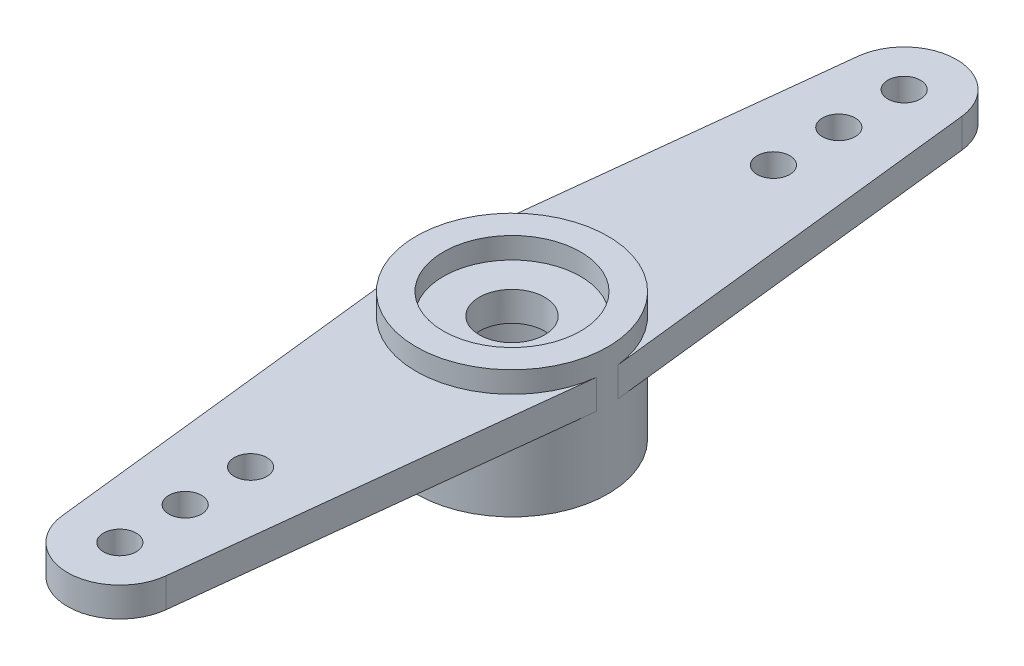
ISO-10303-21;
HEADER;
FILE_DESCRIPTION(('STEP AP214'),'2;1');
FILE_NAME('part.step','',(''),(''),'','','');
FILE_SCHEMA(('AUTOMOTIVE_DESIGN { 1 0 10303 214 1 1 1 1 }'));
ENDSEC;
DATA;
#1=APPLICATION_CONTEXT('core data for automotive mechanical design processes');
#2=APPLICATION_PROTOCOL_DEFINITION('international standard','automotive_design',2000,#1);
#3=PRODUCT_CONTEXT('',#1,'mechanical');
#4=PRODUCT('Part','Part','',(#3));
#5=PRODUCT_RELATED_PRODUCT_CATEGORY('part','',(#4));
#6=PRODUCT_DEFINITION_FORMATION('','',#4);
#7=PRODUCT_DEFINITION_CONTEXT('part definition',#1,'design');
#8=PRODUCT_DEFINITION('design','',#6,#7);
#9=PRODUCT_DEFINITION_SHAPE('','',#8);
#10=(LENGTH_UNIT() NAMED_UNIT(*) SI_UNIT(.MILLI.,.METRE.));
#11=(NAMED_UNIT(*) PLANE_ANGLE_UNIT() SI_UNIT($,.RADIAN.));
#12=(NAMED_UNIT(*) SI_UNIT($,.STERADIAN.) SOLID_ANGLE_UNIT());
#13=UNCERTAINTY_MEASURE_WITH_UNIT(LENGTH_MEASURE(1.E-05),#10,'distance_accuracy_value','');
#14=(GEOMETRIC_REPRESENTATION_CONTEXT(3) GLOBAL_UNCERTAINTY_ASSIGNED_CONTEXT((#13)) GLOBAL_UNIT_ASSIGNED_CONTEXT((#10,
#11,#12)) REPRESENTATION_CONTEXT('',''));
#15=CARTESIAN_POINT('',(0.,0.,0.));
#16=DIRECTION('',(0.,0.,1.));
#17=DIRECTION('',(1.,0.,0.));
#18=AXIS2_PLACEMENT_3D('',#15,#16,#17);
#19=CARTESIAN_POINT('',(0.,-2.4,0.));
#20=DIRECTION('',(0.,1.,0.));
#21=DIRECTION('',(0.,0.,1.));
#22=AXIS2_PLACEMENT_3D('',#19,#20,#21);
#23=CYLINDRICAL_SURFACE('',#22,1.);
#24=CARTESIAN_POINT('',(0.,3.25,0.));
#25=DIRECTION('',(0.,1.,0.));
#26=DIRECTION('',(0.,0.,1.));
#27=AXIS2_PLACEMENT_3D('',#24,#25,#26);
#28=CIRCLE('',#27,1.);
#29=CARTESIAN_POINT('',(0.,3.25,1.));
#30=VERTEX_POINT('',#29);
#31=EDGE_CURVE('E522',#30,#30,#28,.T.);
#32=ORIENTED_EDGE('',*,*,#31,.T.);
#33=EDGE_LOOP('',(#32));
#34=FACE_BOUND('',#33,.T.);
#35=CARTESIAN_POINT('',(0.,2.35,0.));
#36=DIRECTION('',(0.,-1.,0.));
#37=DIRECTION('',(0.,0.,-1.));
#38=AXIS2_PLACEMENT_3D('',#35,#36,#37);
#39=CIRCLE('',#38,1.);
#40=CARTESIAN_POINT('',(0.,2.35,-1.));
#41=VERTEX_POINT('',#40);
#42=EDGE_CURVE('E51',#41,#41,#39,.F.);
#43=ORIENTED_EDGE('',*,*,#42,.F.);
#44=EDGE_LOOP('',(#43));
#45=FACE_BOUND('',#44,.T.);
#46=ADVANCED_FACE('F47',(#34,#45),#23,.F.);
#47=CARTESIAN_POINT('',(0.,3.25,0.));
#48=DIRECTION('',(0.,1.,0.));
#49=DIRECTION('',(0.,0.,1.));
#50=AXIS2_PLACEMENT_3D('',#47,#48,#49);
#51=PLANE('',#50);
#52=CARTESIAN_POINT('',(0.,3.25,0.));
#53=DIRECTION('',(0.,1.,0.));
#54=DIRECTION('',(0.,0.,1.));
#55=AXIS2_PLACEMENT_3D('',#52,#53,#54);
#56=CIRCLE('',#55,2.935);
#57=CARTESIAN_POINT('',(2.91678084639529,3.25,-0.32651875));
#58=VERTEX_POINT('',#57);
#59=CARTESIAN_POINT('',(-2.91678084639529,3.25,-0.32651875));
#60=VERTEX_POINT('',#59);
#61=EDGE_CURVE('E11',#58,#60,#56,.T.);
#62=ORIENTED_EDGE('',*,*,#61,.F.);
#63=DIRECTION('',(0.11125,0.,0.993792451923439));
#64=VECTOR('',#63,1.);
#65=CARTESIAN_POINT('',(2.91678084639529,3.25,-0.32651875));
#66=LINE('',#65,#64);
#67=CARTESIAN_POINT('',(1.5900679230775,3.25,-12.178));
#68=VERTEX_POINT('',#67);
#69=EDGE_CURVE('E240',#68,#58,#66,.T.);
#70=ORIENTED_EDGE('',*,*,#69,.F.);
#71=CARTESIAN_POINT('',(0.,3.25,-12.));
#72=DIRECTION('',(0.,1.,0.));
#73=DIRECTION('',(0.,0.,1.));
#74=AXIS2_PLACEMENT_3D('',#71,#72,#73);
#75=CIRCLE('',#74,1.6);
#76=CARTESIAN_POINT('',(-1.5900679230775,3.25,-12.178));
#77=VERTEX_POINT('',#76);
#78=EDGE_CURVE('E244',#68,#77,#75,.T.);
#79=ORIENTED_EDGE('',*,*,#78,.T.);
#80=DIRECTION('',(-0.11125,0.,0.993792451923439));
#81=VECTOR('',#80,1.);
#82=CARTESIAN_POINT('',(-2.91678084639529,3.25,-0.32651875));
#83=LINE('',#82,#81);
#84=EDGE_CURVE('E65',#77,#60,#83,.T.);
#85=ORIENTED_EDGE('',*,*,#84,.T.);
#86=EDGE_LOOP('',(#62,#70,#79,#85));
#87=FACE_BOUND('',#86,.T.);
#88=CARTESIAN_POINT('',(0.,3.25,-12.));
#89=DIRECTION('',(0.,1.,0.));
#90=DIRECTION('',(0.,0.,1.));
#91=AXIS2_PLACEMENT_3D('',#88,#89,#90);
#92=CIRCLE('',#91,0.5);
#93=CARTESIAN_POINT('',(0.,3.25,-11.5));
#94=VERTEX_POINT('',#93);
#95=EDGE_CURVE('E211',#94,#94,#92,.T.);
#96=ORIENTED_EDGE('',*,*,#95,.F.);
#97=EDGE_LOOP('',(#96));
#98=FACE_BOUND('',#97,.T.);
#99=CARTESIAN_POINT('',(0.,3.25,-10.));
#100=DIRECTION('',(0.,1.,0.));
#101=DIRECTION('',(0.,0.,1.));
#102=AXIS2_PLACEMENT_3D('',#99,#100,#101);
#103=CIRCLE('',#102,0.5);
#104=CARTESIAN_POINT('',(0.,3.25,-9.5));
#105=VERTEX_POINT('',#104);
#106=EDGE_CURVE('E234',#105,#105,#103,.T.);
#107=ORIENTED_EDGE('',*,*,#106,.F.);
#108=EDGE_LOOP('',(#107));
#109=FACE_BOUND('',#108,.T.);
#110=CARTESIAN_POINT('',(0.,3.25,-8.));
#111=DIRECTION('',(0.,1.,0.));
#112=DIRECTION('',(0.,0.,1.));
#113=AXIS2_PLACEMENT_3D('',#110,#111,#112);
#114=CIRCLE('',#113,0.5);
#115=CARTESIAN_POINT('',(0.,3.25,-7.5));
#116=VERTEX_POINT('',#115);
#117=EDGE_CURVE('E201',#116,#116,#114,.T.);
#118=ORIENTED_EDGE('',*,*,#117,.F.);
#119=EDGE_LOOP('',(#118));
#120=FACE_BOUND('',#119,.T.);
#121=ADVANCED_FACE('F266',(#87,#98,#109,#120),#51,.T.);
#122=CARTESIAN_POINT('',(0.,3.25,0.));
#123=DIRECTION('',(0.,-1.,0.));
#124=DIRECTION('',(0.,0.,-1.));
#125=AXIS2_PLACEMENT_3D('',#122,#123,#124);
#126=CYLINDRICAL_SURFACE('',#125,2.935);
#127=DIRECTION('',(0.,1.,0.));
#128=VECTOR('',#127,1.);
#129=CARTESIAN_POINT('',(2.91678084639529,2.35,-0.32651875));
#130=LINE('',#129,#128);
#131=CARTESIAN_POINT('',(2.91678084639529,2.35,-0.32651875));
#132=VERTEX_POINT('',#131);
#133=EDGE_CURVE('E255',#132,#58,#130,.T.);
#134=ORIENTED_EDGE('',*,*,#133,.T.);
#135=ORIENTED_EDGE('',*,*,#61,.T.);
#136=DIRECTION('',(0.,1.,0.));
#137=VECTOR('',#136,1.);
#138=CARTESIAN_POINT('',(-2.91678084639529,2.35,-0.32651875));
#139=LINE('',#138,#137);
#140=CARTESIAN_POINT('',(-2.91678084639529,2.35,-0.32651875));
#141=VERTEX_POINT('',#140);
#142=EDGE_CURVE('E230',#141,#60,#139,.T.);
#143=ORIENTED_EDGE('',*,*,#142,.F.);
#144=CARTESIAN_POINT('',(0.,2.35,0.));
#145=DIRECTION('',(0.,1.,0.));
#146=DIRECTION('',(0.,0.,1.));
#147=AXIS2_PLACEMENT_3D('',#144,#145,#146);
#148=CIRCLE('',#147,2.935);
#149=EDGE_CURVE('E95',#132,#141,#148,.T.);
#150=ORIENTED_EDGE('',*,*,#149,.F.);
#151=EDGE_LOOP('',(#134,#135,#143,#150));
#152=FACE_BOUND('',#151,.T.);
#153=CARTESIAN_POINT('',(0.,0.,0.));
#154=DIRECTION('',(0.,1.,0.));
#155=DIRECTION('',(0.,0.,1.));
#156=AXIS2_PLACEMENT_3D('',#153,#154,#155);
#157=CIRCLE('',#156,2.935);
#158=CARTESIAN_POINT('',(0.,0.,2.935));
#159=VERTEX_POINT('',#158);
#160=EDGE_CURVE('E150',#159,#159,#157,.T.);
#161=ORIENTED_EDGE('',*,*,#160,.T.);
#162=EDGE_LOOP('',(#161));
#163=FACE_BOUND('',#162,.T.);
#164=DIRECTION('',(0.,1.,0.));
#165=VECTOR('',#164,1.);
#166=CARTESIAN_POINT('',(-2.91678084639529,2.35,0.32651875));
#167=LINE('',#166,#165);
#168=CARTESIAN_POINT('',(-2.91678084639529,2.35,0.32651875));
#169=VERTEX_POINT('',#168);
#170=CARTESIAN_POINT('',(-2.91678084639529,3.25,0.32651875));
#171=VERTEX_POINT('',#170);
#172=EDGE_CURVE('E133',#169,#171,#167,.T.);
#173=ORIENTED_EDGE('',*,*,#172,.T.);
#174=CARTESIAN_POINT('',(2.91678084639529,3.25,0.32651875));
#175=VERTEX_POINT('',#174);
#176=EDGE_CURVE('E57',#171,#175,#56,.T.);
#177=ORIENTED_EDGE('',*,*,#176,.T.);
#178=DIRECTION('',(0.,1.,0.));
#179=VECTOR('',#178,1.);
#180=CARTESIAN_POINT('',(2.91678084639529,2.35,0.32651875));
#181=LINE('',#180,#179);
#182=CARTESIAN_POINT('',(2.91678084639529,2.35,0.32651875));
#183=VERTEX_POINT('',#182);
#184=EDGE_CURVE('E123',#183,#175,#181,.T.);
#185=ORIENTED_EDGE('',*,*,#184,.F.);
#186=CARTESIAN_POINT('',(0.,2.35,0.));
#187=DIRECTION('',(0.,1.,0.));
#188=DIRECTION('',(0.,0.,1.));
#189=AXIS2_PLACEMENT_3D('',#186,#187,#188);
#190=CIRCLE('',#189,2.935);
#191=EDGE_CURVE('E164',#169,#183,#190,.T.);
#192=ORIENTED_EDGE('',*,*,#191,.F.);
#193=EDGE_LOOP('',(#173,#177,#185,#192));
#194=FACE_BOUND('',#193,.T.);
#195=CARTESIAN_POINT('',(0.,3.9,0.));
#196=DIRECTION('',(0.,1.,0.));
#197=DIRECTION('',(0.,0.,1.));
#198=AXIS2_PLACEMENT_3D('',#195,#196,#197);
#199=CIRCLE('',#198,2.935);
#200=CARTESIAN_POINT('',(0.,3.9,2.935));
#201=VERTEX_POINT('',#200);
#202=EDGE_CURVE('E155',#201,#201,#199,.T.);
#203=ORIENTED_EDGE('',*,*,#202,.F.);
#204=EDGE_LOOP('',(#203));
#205=FACE_BOUND('',#204,.T.);
#206=ADVANCED_FACE('F49',(#152,#163,#194,#205),#126,.T.);
#207=ORIENTED_EDGE('',*,*,#176,.F.);
#208=DIRECTION('',(-0.11125,0.,-0.993792451923439));
#209=VECTOR('',#208,1.);
#210=CARTESIAN_POINT('',(-2.91678084639529,3.25,0.32651875));
#211=LINE('',#210,#209);
#212=CARTESIAN_POINT('',(-1.5900679230775,3.25,12.178));
#213=VERTEX_POINT('',#212);
#214=EDGE_CURVE('E144',#213,#171,#211,.T.);
#215=ORIENTED_EDGE('',*,*,#214,.F.);
#216=CARTESIAN_POINT('',(0.,3.25,12.));
#217=DIRECTION('',(0.,1.,0.));
#218=DIRECTION('',(0.,0.,1.));
#219=AXIS2_PLACEMENT_3D('',#216,#217,#218);
#220=CIRCLE('',#219,1.6);
#221=CARTESIAN_POINT('',(1.5900679230775,3.25,12.178));
#222=VERTEX_POINT('',#221);
#223=EDGE_CURVE('E142',#222,#213,#220,.F.);
#224=ORIENTED_EDGE('',*,*,#223,.F.);
#225=DIRECTION('',(0.11125,0.,-0.993792451923439));
#226=VECTOR('',#225,1.);
#227=CARTESIAN_POINT('',(2.91678084639529,3.25,0.32651875));
#228=LINE('',#227,#226);
#229=EDGE_CURVE('E126',#222,#175,#228,.T.);
#230=ORIENTED_EDGE('',*,*,#229,.T.);
#231=EDGE_LOOP('',(#207,#215,#224,#230));
#232=FACE_BOUND('',#231,.T.);
#233=CARTESIAN_POINT('',(0.,3.25,10.));
#234=DIRECTION('',(0.,1.,0.));
#235=DIRECTION('',(0.,0.,1.));
#236=AXIS2_PLACEMENT_3D('',#233,#234,#235);
#237=CIRCLE('',#236,0.5);
#238=CARTESIAN_POINT('',(0.,3.25,10.5));
#239=VERTEX_POINT('',#238);
#240=EDGE_CURVE('E186',#239,#239,#237,.F.);
#241=ORIENTED_EDGE('',*,*,#240,.T.);
#242=EDGE_LOOP('',(#241));
#243=FACE_BOUND('',#242,.T.);
#244=CARTESIAN_POINT('',(0.,3.25,8.));
#245=DIRECTION('',(0.,1.,0.));
#246=DIRECTION('',(0.,0.,1.));
#247=AXIS2_PLACEMENT_3D('',#244,#245,#246);
#248=CIRCLE('',#247,0.5);
#249=CARTESIAN_POINT('',(0.,3.25,8.5));
#250=VERTEX_POINT('',#249);
#251=EDGE_CURVE('E190',#250,#250,#248,.F.);
#252=ORIENTED_EDGE('',*,*,#251,.T.);
#253=EDGE_LOOP('',(#252));
#254=FACE_BOUND('',#253,.T.);
#255=CARTESIAN_POINT('',(0.,3.25,12.));
#256=DIRECTION('',(0.,1.,0.));
#257=DIRECTION('',(0.,0.,1.));
#258=AXIS2_PLACEMENT_3D('',#255,#256,#257);
#259=CIRCLE('',#258,0.5);
#260=CARTESIAN_POINT('',(0.,3.25,12.5));
#261=VERTEX_POINT('',#260);
#262=EDGE_CURVE('E161',#261,#261,#259,.F.);
#263=ORIENTED_EDGE('',*,*,#262,.T.);
#264=EDGE_LOOP('',(#263));
#265=FACE_BOUND('',#264,.T.);
#266=ADVANCED_FACE('F138',(#232,#243,#254,#265),#51,.T.);
#267=CARTESIAN_POINT('',(0.,0.,0.));
#268=DIRECTION('',(0.,1.,0.));
#269=DIRECTION('',(0.,0.,1.));
#270=AXIS2_PLACEMENT_3D('',#267,#268,#269);
#271=PLANE('',#270);
#272=CARTESIAN_POINT('',(0.,0.,0.));
#273=DIRECTION('',(0.,-1.,0.));
#274=DIRECTION('',(0.,0.,-1.));
#275=AXIS2_PLACEMENT_3D('',#272,#273,#274);
#276=CIRCLE('',#275,2.1);
#277=CARTESIAN_POINT('',(0.,0.,-2.1));
#278=VERTEX_POINT('',#277);
#279=EDGE_CURVE('E370',#278,#278,#276,.T.);
#280=ORIENTED_EDGE('',*,*,#279,.F.);
#281=EDGE_LOOP('',(#280));
#282=FACE_BOUND('',#281,.T.);
#283=ORIENTED_EDGE('',*,*,#160,.F.);
#284=EDGE_LOOP('',(#283));
#285=FACE_BOUND('',#284,.T.);
#286=ADVANCED_FACE('F359',(#282,#285),#271,.F.);
#287=CARTESIAN_POINT('',(-2.91678084639529,2.35,-0.32651875));
#288=DIRECTION('',(-0.993792451923439,0.,-0.11125));
#289=DIRECTION('',(-0.11125,0.,0.993792451923439));
#290=AXIS2_PLACEMENT_3D('',#287,#288,#289);
#291=PLANE('',#290);
#292=ORIENTED_EDGE('',*,*,#84,.F.);
#293=DIRECTION('',(0.,1.,0.));
#294=VECTOR('',#293,1.);
#295=CARTESIAN_POINT('',(-1.5900679230775,2.35,-12.178));
#296=LINE('',#295,#294);
#297=CARTESIAN_POINT('',(-1.5900679230775,2.35,-12.178));
#298=VERTEX_POINT('',#297);
#299=EDGE_CURVE('E73',#298,#77,#296,.T.);
#300=ORIENTED_EDGE('',*,*,#299,.F.);
#301=DIRECTION('',(-0.11125,0.,0.993792451923439));
#302=VECTOR('',#301,1.);
#303=CARTESIAN_POINT('',(-2.91678084639529,2.35,-0.32651875));
#304=LINE('',#303,#302);
#305=EDGE_CURVE('E215',#298,#141,#304,.T.);
#306=ORIENTED_EDGE('',*,*,#305,.T.);
#307=ORIENTED_EDGE('',*,*,#142,.T.);
#308=EDGE_LOOP('',(#292,#300,#306,#307));
#309=FACE_BOUND('',#308,.T.);
#310=ADVANCED_FACE('F261',(#309),#291,.T.);
#311=CARTESIAN_POINT('',(0.,2.35,-12.));
#312=DIRECTION('',(0.,1.,0.));
#313=DIRECTION('',(0.,0.,1.));
#314=AXIS2_PLACEMENT_3D('',#311,#312,#313);
#315=CYLINDRICAL_SURFACE('',#314,1.6);
#316=ORIENTED_EDGE('',*,*,#78,.F.);
#317=DIRECTION('',(0.,1.,0.));
#318=VECTOR('',#317,1.);
#319=CARTESIAN_POINT('',(1.5900679230775,2.35,-12.178));
#320=LINE('',#319,#318);
#321=CARTESIAN_POINT('',(1.5900679230775,2.35,-12.178));
#322=VERTEX_POINT('',#321);
#323=EDGE_CURVE('E252',#322,#68,#320,.T.);
#324=ORIENTED_EDGE('',*,*,#323,.F.);
#325=CARTESIAN_POINT('',(0.,2.35,-12.));
#326=DIRECTION('',(0.,1.,0.));
#327=DIRECTION('',(0.,0.,1.));
#328=AXIS2_PLACEMENT_3D('',#325,#326,#327);
#329=CIRCLE('',#328,1.6);
#330=EDGE_CURVE('E223',#322,#298,#329,.T.);
#331=ORIENTED_EDGE('',*,*,#330,.T.);
#332=ORIENTED_EDGE('',*,*,#299,.T.);
#333=EDGE_LOOP('',(#316,#324,#331,#332));
#334=FACE_BOUND('',#333,.T.);
#335=ADVANCED_FACE('F272',(#334),#315,.T.);
#336=CARTESIAN_POINT('',(2.91678084639529,2.35,-0.32651875));
#337=DIRECTION('',(-0.993792451923439,0.,0.11125));
#338=DIRECTION('',(0.11125,0.,0.993792451923439));
#339=AXIS2_PLACEMENT_3D('',#336,#337,#338);
#340=PLANE('',#339);
#341=ORIENTED_EDGE('',*,*,#69,.T.);
#342=ORIENTED_EDGE('',*,*,#133,.F.);
#343=DIRECTION('',(0.11125,0.,0.993792451923439));
#344=VECTOR('',#343,1.);
#345=CARTESIAN_POINT('',(2.91678084639529,2.35,-0.32651875));
#346=LINE('',#345,#344);
#347=EDGE_CURVE('E220',#322,#132,#346,.T.);
#348=ORIENTED_EDGE('',*,*,#347,.F.);
#349=ORIENTED_EDGE('',*,*,#323,.T.);
#350=EDGE_LOOP('',(#341,#342,#348,#349));
#351=FACE_BOUND('',#350,.T.);
#352=ADVANCED_FACE('F269',(#351),#340,.F.);
#353=CARTESIAN_POINT('',(0.,2.35,-10.));
#354=DIRECTION('',(0.,1.,0.));
#355=DIRECTION('',(0.,0.,1.));
#356=AXIS2_PLACEMENT_3D('',#353,#354,#355);
#357=CYLINDRICAL_SURFACE('',#356,0.5);
#358=CARTESIAN_POINT('',(0.,2.35,-10.));
#359=DIRECTION('',(0.,1.,0.));
#360=DIRECTION('',(0.,0.,1.));
#361=AXIS2_PLACEMENT_3D('',#358,#359,#360);
#362=CIRCLE('',#361,0.5);
#363=CARTESIAN_POINT('',(0.,2.35,-9.5));
#364=VERTEX_POINT('',#363);
#365=EDGE_CURVE('E210',#364,#364,#362,.T.);
#366=ORIENTED_EDGE('',*,*,#365,.F.);
#367=EDGE_LOOP('',(#366));
#368=FACE_BOUND('',#367,.T.);
#369=ORIENTED_EDGE('',*,*,#106,.T.);
#370=EDGE_LOOP('',(#369));
#371=FACE_BOUND('',#370,.T.);
#372=ADVANCED_FACE('F295',(#368,#371),#357,.F.);
#373=CARTESIAN_POINT('',(0.,2.35,-8.));
#374=DIRECTION('',(0.,1.,0.));
#375=DIRECTION('',(0.,0.,1.));
#376=AXIS2_PLACEMENT_3D('',#373,#374,#375);
#377=CYLINDRICAL_SURFACE('',#376,0.5);
#378=CARTESIAN_POINT('',(0.,2.35,-8.));
#379=DIRECTION('',(0.,1.,0.));
#380=DIRECTION('',(0.,0.,1.));
#381=AXIS2_PLACEMENT_3D('',#378,#379,#380);
#382=CIRCLE('',#381,0.5);
#383=CARTESIAN_POINT('',(0.,2.35,-7.5));
#384=VERTEX_POINT('',#383);
#385=EDGE_CURVE('E206',#384,#384,#382,.T.);
#386=ORIENTED_EDGE('',*,*,#385,.F.);
#387=EDGE_LOOP('',(#386));
#388=FACE_BOUND('',#387,.T.);
#389=ORIENTED_EDGE('',*,*,#117,.T.);
#390=EDGE_LOOP('',(#389));
#391=FACE_BOUND('',#390,.T.);
#392=ADVANCED_FACE('F284',(#388,#391),#377,.F.);
#393=CARTESIAN_POINT('',(0.,2.35,-12.));
#394=DIRECTION('',(0.,1.,0.));
#395=DIRECTION('',(0.,0.,1.));
#396=AXIS2_PLACEMENT_3D('',#393,#394,#395);
#397=CYLINDRICAL_SURFACE('',#396,0.5);
#398=CARTESIAN_POINT('',(0.,2.35,-12.));
#399=DIRECTION('',(0.,1.,0.));
#400=DIRECTION('',(0.,0.,1.));
#401=AXIS2_PLACEMENT_3D('',#398,#399,#400);
#402=CIRCLE('',#401,0.5);
#403=CARTESIAN_POINT('',(0.,2.35,-11.5));
#404=VERTEX_POINT('',#403);
#405=EDGE_CURVE('E226',#404,#404,#402,.T.);
#406=ORIENTED_EDGE('',*,*,#405,.F.);
#407=EDGE_LOOP('',(#406));
#408=FACE_BOUND('',#407,.T.);
#409=ORIENTED_EDGE('',*,*,#95,.T.);
#410=EDGE_LOOP('',(#409));
#411=FACE_BOUND('',#410,.T.);
#412=ADVANCED_FACE('F277',(#408,#411),#397,.F.);
#413=CARTESIAN_POINT('',(0.,2.35,0.));
#414=DIRECTION('',(0.,1.,0.));
#415=DIRECTION('',(0.,0.,1.));
#416=AXIS2_PLACEMENT_3D('',#413,#414,#415);
#417=PLANE('',#416);
#418=ORIENTED_EDGE('',*,*,#385,.T.);
#419=EDGE_LOOP('',(#418));
#420=FACE_BOUND('',#419,.T.);
#421=ORIENTED_EDGE('',*,*,#365,.T.);
#422=EDGE_LOOP('',(#421));
#423=FACE_BOUND('',#422,.T.);
#424=ORIENTED_EDGE('',*,*,#305,.F.);
#425=ORIENTED_EDGE('',*,*,#330,.F.);
#426=ORIENTED_EDGE('',*,*,#347,.T.);
#427=ORIENTED_EDGE('',*,*,#149,.T.);
#428=EDGE_LOOP('',(#424,#425,#426,#427));
#429=FACE_BOUND('',#428,.T.);
#430=ORIENTED_EDGE('',*,*,#405,.T.);
#431=EDGE_LOOP('',(#430));
#432=FACE_BOUND('',#431,.T.);
#433=ADVANCED_FACE('F273',(#420,#423,#429,#432),#417,.F.);
#434=CARTESIAN_POINT('',(0.,2.35,12.));
#435=DIRECTION('',(0.,1.,0.));
#436=DIRECTION('',(0.,0.,1.));
#437=AXIS2_PLACEMENT_3D('',#434,#435,#436);
#438=CYLINDRICAL_SURFACE('',#437,1.6);
#439=ORIENTED_EDGE('',*,*,#223,.T.);
#440=DIRECTION('',(0.,1.,0.));
#441=VECTOR('',#440,1.);
#442=CARTESIAN_POINT('',(-1.5900679230775,2.35,12.178));
#443=LINE('',#442,#441);
#444=CARTESIAN_POINT('',(-1.5900679230775,2.35,12.178));
#445=VERTEX_POINT('',#444);
#446=EDGE_CURVE('E197',#445,#213,#443,.T.);
#447=ORIENTED_EDGE('',*,*,#446,.F.);
#448=CARTESIAN_POINT('',(0.,2.35,12.));
#449=DIRECTION('',(0.,1.,0.));
#450=DIRECTION('',(0.,0.,1.));
#451=AXIS2_PLACEMENT_3D('',#448,#449,#450);
#452=CIRCLE('',#451,1.6);
#453=CARTESIAN_POINT('',(1.5900679230775,2.35,12.178));
#454=VERTEX_POINT('',#453);
#455=EDGE_CURVE('E157',#454,#445,#452,.F.);
#456=ORIENTED_EDGE('',*,*,#455,.F.);
#457=DIRECTION('',(0.,1.,0.));
#458=VECTOR('',#457,1.);
#459=CARTESIAN_POINT('',(1.5900679230775,2.35,12.178));
#460=LINE('',#459,#458);
#461=EDGE_CURVE('E134',#454,#222,#460,.T.);
#462=ORIENTED_EDGE('',*,*,#461,.T.);
#463=EDGE_LOOP('',(#439,#447,#456,#462));
#464=FACE_BOUND('',#463,.T.);
#465=ADVANCED_FACE('F276',(#464),#438,.T.);
#466=CARTESIAN_POINT('',(-2.91678084639529,2.35,0.32651875));
#467=DIRECTION('',(0.993792451923439,0.,-0.11125));
#468=DIRECTION('',(-0.11125,0.,-0.993792451923439));
#469=AXIS2_PLACEMENT_3D('',#466,#467,#468);
#470=PLANE('',#469);
#471=ORIENTED_EDGE('',*,*,#214,.T.);
#472=ORIENTED_EDGE('',*,*,#172,.F.);
#473=DIRECTION('',(-0.11125,0.,-0.993792451923439));
#474=VECTOR('',#473,1.);
#475=CARTESIAN_POINT('',(-2.91678084639529,2.35,0.32651875));
#476=LINE('',#475,#474);
#477=EDGE_CURVE('E167',#445,#169,#476,.T.);
#478=ORIENTED_EDGE('',*,*,#477,.F.);
#479=ORIENTED_EDGE('',*,*,#446,.T.);
#480=EDGE_LOOP('',(#471,#472,#478,#479));
#481=FACE_BOUND('',#480,.T.);
#482=ADVANCED_FACE('F341',(#481),#470,.F.);
#483=CARTESIAN_POINT('',(0.,2.35,8.));
#484=DIRECTION('',(0.,1.,0.));
#485=DIRECTION('',(0.,0.,1.));
#486=AXIS2_PLACEMENT_3D('',#483,#484,#485);
#487=CYLINDRICAL_SURFACE('',#486,0.5);
#488=CARTESIAN_POINT('',(0.,2.35,8.));
#489=DIRECTION('',(0.,1.,0.));
#490=DIRECTION('',(0.,0.,1.));
#491=AXIS2_PLACEMENT_3D('',#488,#489,#490);
#492=CIRCLE('',#491,0.5);
#493=CARTESIAN_POINT('',(0.,2.35,8.5));
#494=VERTEX_POINT('',#493);
#495=EDGE_CURVE('E174',#494,#494,#492,.F.);
#496=ORIENTED_EDGE('',*,*,#495,.T.);
#497=EDGE_LOOP('',(#496));
#498=FACE_BOUND('',#497,.T.);
#499=ORIENTED_EDGE('',*,*,#251,.F.);
#500=EDGE_LOOP('',(#499));
#501=FACE_BOUND('',#500,.T.);
#502=ADVANCED_FACE('F337',(#498,#501),#487,.F.);
#503=CARTESIAN_POINT('',(0.,2.35,10.));
#504=DIRECTION('',(0.,1.,0.));
#505=DIRECTION('',(0.,0.,1.));
#506=AXIS2_PLACEMENT_3D('',#503,#504,#505);
#507=CYLINDRICAL_SURFACE('',#506,0.5);
#508=CARTESIAN_POINT('',(0.,2.35,10.));
#509=DIRECTION('',(0.,1.,0.));
#510=DIRECTION('',(0.,0.,1.));
#511=AXIS2_PLACEMENT_3D('',#508,#509,#510);
#512=CIRCLE('',#511,0.5);
#513=CARTESIAN_POINT('',(0.,2.35,10.5));
#514=VERTEX_POINT('',#513);
#515=EDGE_CURVE('E170',#514,#514,#512,.F.);
#516=ORIENTED_EDGE('',*,*,#515,.T.);
#517=EDGE_LOOP('',(#516));
#518=FACE_BOUND('',#517,.T.);
#519=ORIENTED_EDGE('',*,*,#240,.F.);
#520=EDGE_LOOP('',(#519));
#521=FACE_BOUND('',#520,.T.);
#522=ADVANCED_FACE('F340',(#518,#521),#507,.F.);
#523=CARTESIAN_POINT('',(2.91678084639529,2.35,0.32651875));
#524=DIRECTION('',(0.993792451923439,0.,0.11125));
#525=DIRECTION('',(0.11125,0.,-0.993792451923439));
#526=AXIS2_PLACEMENT_3D('',#523,#524,#525);
#527=PLANE('',#526);
#528=ORIENTED_EDGE('',*,*,#229,.F.);
#529=ORIENTED_EDGE('',*,*,#461,.F.);
#530=DIRECTION('',(0.11125,0.,-0.993792451923439));
#531=VECTOR('',#530,1.);
#532=CARTESIAN_POINT('',(2.91678084639529,2.35,0.32651875));
#533=LINE('',#532,#531);
#534=EDGE_CURVE('E128',#454,#183,#533,.T.);
#535=ORIENTED_EDGE('',*,*,#534,.T.);
#536=ORIENTED_EDGE('',*,*,#184,.T.);
#537=EDGE_LOOP('',(#528,#529,#535,#536));
#538=FACE_BOUND('',#537,.T.);
#539=ADVANCED_FACE('F125',(#538),#527,.T.);
#540=CARTESIAN_POINT('',(0.,2.35,12.));
#541=DIRECTION('',(0.,1.,0.));
#542=DIRECTION('',(0.,0.,1.));
#543=AXIS2_PLACEMENT_3D('',#540,#541,#542);
#544=CYLINDRICAL_SURFACE('',#543,0.5);
#545=CARTESIAN_POINT('',(0.,2.35,12.));
#546=DIRECTION('',(0.,1.,0.));
#547=DIRECTION('',(0.,0.,1.));
#548=AXIS2_PLACEMENT_3D('',#545,#546,#547);
#549=CIRCLE('',#548,0.5);
#550=CARTESIAN_POINT('',(0.,2.35,12.5));
#551=VERTEX_POINT('',#550);
#552=EDGE_CURVE('E178',#551,#551,#549,.F.);
#553=ORIENTED_EDGE('',*,*,#552,.T.);
#554=EDGE_LOOP('',(#553));
#555=FACE_BOUND('',#554,.T.);
#556=ORIENTED_EDGE('',*,*,#262,.F.);
#557=EDGE_LOOP('',(#556));
#558=FACE_BOUND('',#557,.T.);
#559=ADVANCED_FACE('F332',(#555,#558),#544,.F.);
#560=CARTESIAN_POINT('',(0.,2.35,0.));
#561=DIRECTION('',(0.,1.,0.));
#562=DIRECTION('',(0.,0.,1.));
#563=AXIS2_PLACEMENT_3D('',#560,#561,#562);
#564=PLANE('',#563);
#565=ORIENTED_EDGE('',*,*,#455,.T.);
#566=ORIENTED_EDGE('',*,*,#477,.T.);
#567=ORIENTED_EDGE('',*,*,#191,.T.);
#568=ORIENTED_EDGE('',*,*,#534,.F.);
#569=EDGE_LOOP('',(#565,#566,#567,#568));
#570=FACE_BOUND('',#569,.T.);
#571=ORIENTED_EDGE('',*,*,#515,.F.);
#572=EDGE_LOOP('',(#571));
#573=FACE_BOUND('',#572,.T.);
#574=ORIENTED_EDGE('',*,*,#495,.F.);
#575=EDGE_LOOP('',(#574));
#576=FACE_BOUND('',#575,.T.);
#577=ORIENTED_EDGE('',*,*,#552,.F.);
#578=EDGE_LOOP('',(#577));
#579=FACE_BOUND('',#578,.T.);
#580=ADVANCED_FACE('F328',(#570,#573,#576,#579),#564,.F.);
#581=CARTESIAN_POINT('',(0.,3.9,0.));
#582=DIRECTION('',(0.,1.,0.));
#583=DIRECTION('',(0.,0.,1.));
#584=AXIS2_PLACEMENT_3D('',#581,#582,#583);
#585=PLANE('',#584);
#586=CARTESIAN_POINT('',(0.,3.9,0.));
#587=DIRECTION('',(0.,1.,0.));
#588=DIRECTION('',(0.,0.,1.));
#589=AXIS2_PLACEMENT_3D('',#586,#587,#588);
#590=CIRCLE('',#589,2.1);
#591=CARTESIAN_POINT('',(0.,3.9,2.1));
#592=VERTEX_POINT('',#591);
#593=EDGE_CURVE('E525',#592,#592,#590,.T.);
#594=ORIENTED_EDGE('',*,*,#593,.F.);
#595=EDGE_LOOP('',(#594));
#596=FACE_BOUND('',#595,.T.);
#597=ORIENTED_EDGE('',*,*,#202,.T.);
#598=EDGE_LOOP('',(#597));
#599=FACE_BOUND('',#598,.T.);
#600=ADVANCED_FACE('F324',(#596,#599),#585,.T.);
#601=CARTESIAN_POINT('',(0.,3.25,0.));
#602=DIRECTION('',(0.,1.,0.));
#603=DIRECTION('',(0.,0.,1.));
#604=AXIS2_PLACEMENT_3D('',#601,#602,#603);
#605=CYLINDRICAL_SURFACE('',#604,2.1);
#606=CARTESIAN_POINT('',(0.,3.25,0.));
#607=DIRECTION('',(0.,1.,0.));
#608=DIRECTION('',(0.,0.,1.));
#609=AXIS2_PLACEMENT_3D('',#606,#607,#608);
#610=CIRCLE('',#609,2.1);
#611=CARTESIAN_POINT('',(0.,3.25,2.1));
#612=VERTEX_POINT('',#611);
#613=EDGE_CURVE('E526',#612,#612,#610,.T.);
#614=ORIENTED_EDGE('',*,*,#613,.F.);
#615=EDGE_LOOP('',(#614));
#616=FACE_BOUND('',#615,.T.);
#617=ORIENTED_EDGE('',*,*,#593,.T.);
#618=EDGE_LOOP('',(#617));
#619=FACE_BOUND('',#618,.T.);
#620=ADVANCED_FACE('F320',(#616,#619),#605,.F.);
#621=CARTESIAN_POINT('',(0.,3.25,0.));
#622=DIRECTION('',(0.,1.,0.));
#623=DIRECTION('',(0.,0.,1.));
#624=AXIS2_PLACEMENT_3D('',#621,#622,#623);
#625=PLANE('',#624);
#626=ORIENTED_EDGE('',*,*,#31,.F.);
#627=EDGE_LOOP('',(#626));
#628=FACE_BOUND('',#627,.T.);
#629=ORIENTED_EDGE('',*,*,#613,.T.);
#630=EDGE_LOOP('',(#629));
#631=FACE_BOUND('',#630,.T.);
#632=ADVANCED_FACE('F317',(#628,#631),#625,.T.);
#633=CARTESIAN_POINT('',(0.,2.35,0.));
#634=DIRECTION('',(0.,-1.,0.));
#635=DIRECTION('',(0.,0.,-1.));
#636=AXIS2_PLACEMENT_3D('',#633,#634,#635);
#637=PLANE('',#636);
#638=CARTESIAN_POINT('',(0.,2.35,0.));
#639=DIRECTION('',(0.,-1.,0.));
#640=DIRECTION('',(0.,0.,-1.));
#641=AXIS2_PLACEMENT_3D('',#638,#639,#640);
#642=CIRCLE('',#641,2.1);
#643=CARTESIAN_POINT('',(0.,2.35,-2.1));
#644=VERTEX_POINT('',#643);
#645=EDGE_CURVE('E516',#644,#644,#642,.T.);
#646=ORIENTED_EDGE('',*,*,#645,.T.);
#647=EDGE_LOOP('',(#646));
#648=FACE_BOUND('',#647,.T.);
#649=ORIENTED_EDGE('',*,*,#42,.T.);
#650=EDGE_LOOP('',(#649));
#651=FACE_BOUND('',#650,.T.);
#652=ADVANCED_FACE('F319',(#648,#651),#637,.T.);
#653=CARTESIAN_POINT('',(0.,2.35,0.));
#654=DIRECTION('',(0.,-1.,0.));
#655=DIRECTION('',(0.,0.,-1.));
#656=AXIS2_PLACEMENT_3D('',#653,#654,#655);
#657=CYLINDRICAL_SURFACE('',#656,2.1);
#658=ORIENTED_EDGE('',*,*,#645,.F.);
#659=EDGE_LOOP('',(#658));
#660=FACE_BOUND('',#659,.T.);
#661=ORIENTED_EDGE('',*,*,#279,.T.);
#662=EDGE_LOOP('',(#661));
#663=FACE_BOUND('',#662,.T.);
#664=ADVANCED_FACE('F315',(#660,#663),#657,.F.);
#665=CLOSED_SHELL('',(#46,#121,#206,#266,#286,#310,#335,#352,#372,#392,#412,#433,#465,#482,#502,
#522,#539,#559,#580,#600,#620,#632,#652,#664));
#666=MANIFOLD_SOLID_BREP('B2',#665);
#667=ADVANCED_BREP_SHAPE_REPRESENTATION('',(#18,#666),#14);
#668=SHAPE_DEFINITION_REPRESENTATION(#9,#667);
ENDSEC;
END-ISO-10303-21;
